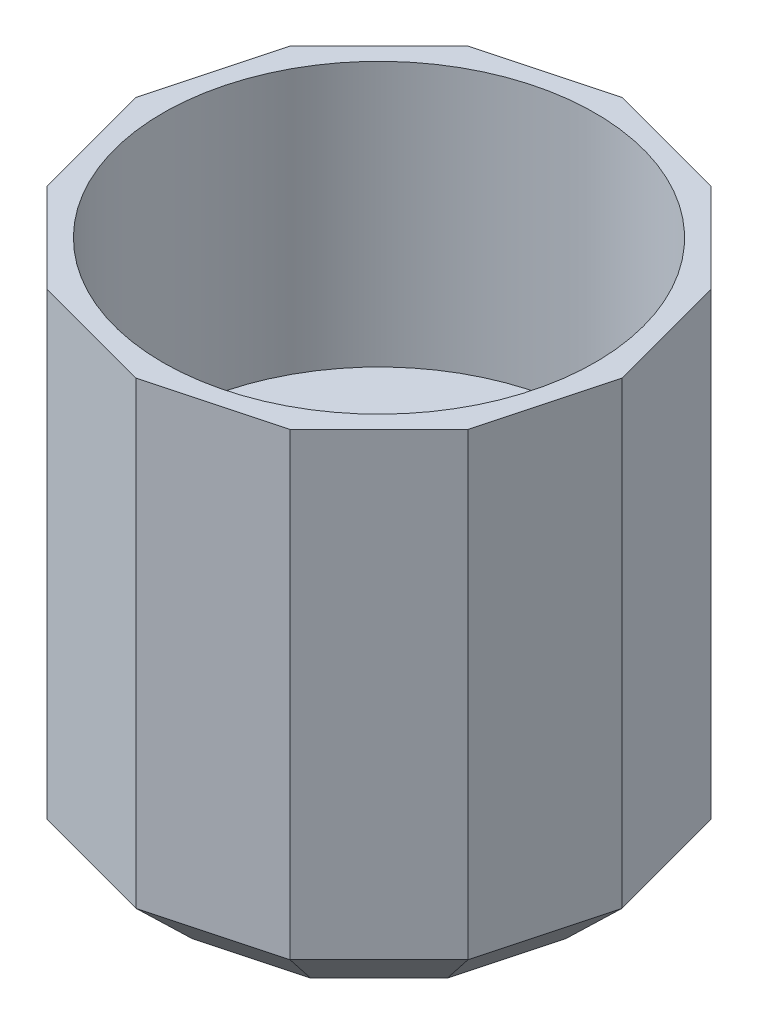
ISO-10303-21;
HEADER;
FILE_DESCRIPTION(('STEP AP214'),'2;1');
FILE_NAME('part.step','',(''),(''),'','','');
FILE_SCHEMA(('AUTOMOTIVE_DESIGN { 1 0 10303 214 1 1 1 1 }'));
ENDSEC;
DATA;
#1=APPLICATION_CONTEXT('core data for automotive mechanical design processes');
#2=APPLICATION_PROTOCOL_DEFINITION('international standard','automotive_design',2000,#1);
#3=PRODUCT_CONTEXT('',#1,'mechanical');
#4=PRODUCT('Part','Part','',(#3));
#5=PRODUCT_RELATED_PRODUCT_CATEGORY('part','',(#4));
#6=PRODUCT_DEFINITION_FORMATION('','',#4);
#7=PRODUCT_DEFINITION_CONTEXT('part definition',#1,'design');
#8=PRODUCT_DEFINITION('design','',#6,#7);
#9=PRODUCT_DEFINITION_SHAPE('','',#8);
#10=(LENGTH_UNIT() NAMED_UNIT(*) SI_UNIT(.MILLI.,.METRE.));
#11=(NAMED_UNIT(*) PLANE_ANGLE_UNIT() SI_UNIT($,.RADIAN.));
#12=(NAMED_UNIT(*) SI_UNIT($,.STERADIAN.) SOLID_ANGLE_UNIT());
#13=UNCERTAINTY_MEASURE_WITH_UNIT(LENGTH_MEASURE(1.E-05),#10,'distance_accuracy_value','');
#14=(GEOMETRIC_REPRESENTATION_CONTEXT(3) GLOBAL_UNCERTAINTY_ASSIGNED_CONTEXT((#13)) GLOBAL_UNIT_ASSIGNED_CONTEXT((#10,
#11,#12)) REPRESENTATION_CONTEXT('',''));
#15=CARTESIAN_POINT('',(0.,0.,0.));
#16=DIRECTION('',(0.,0.,1.));
#17=DIRECTION('',(1.,0.,0.));
#18=AXIS2_PLACEMENT_3D('',#15,#16,#17);
#19=CARTESIAN_POINT('',(0.,-4.8,0.));
#20=DIRECTION('',(0.,1.,0.));
#21=DIRECTION('',(0.,0.,1.));
#22=AXIS2_PLACEMENT_3D('',#19,#20,#21);
#23=CYLINDRICAL_SURFACE('',#22,3.05);
#24=CARTESIAN_POINT('',(0.,9.2,0.));
#25=DIRECTION('',(0.,1.,0.));
#26=DIRECTION('',(0.,0.,1.));
#27=AXIS2_PLACEMENT_3D('',#24,#25,#26);
#28=CIRCLE('',#27,3.05);
#29=CARTESIAN_POINT('',(0.,9.2,3.05));
#30=VERTEX_POINT('',#29);
#31=EDGE_CURVE('E216',#30,#30,#28,.T.);
#32=ORIENTED_EDGE('',*,*,#31,.T.);
#33=EDGE_LOOP('',(#32));
#34=FACE_BOUND('',#33,.T.);
#35=DIRECTION('',(0.,1.,0.));
#36=VECTOR('',#35,1.);
#37=CARTESIAN_POINT('',(-0.4,-4.8,3.02365672654817));
#38=LINE('',#37,#36);
#39=CARTESIAN_POINT('',(-0.4,6.2,3.02365672654817));
#40=VERTEX_POINT('',#39);
#41=CARTESIAN_POINT('',(-0.4,8.2,3.02365672654817));
#42=VERTEX_POINT('',#41);
#43=EDGE_CURVE('E206',#40,#42,#38,.T.);
#44=ORIENTED_EDGE('',*,*,#43,.F.);
#45=CARTESIAN_POINT('',(0.,6.2,0.));
#46=DIRECTION('',(0.,1.,0.));
#47=DIRECTION('',(0.,0.,1.));
#48=AXIS2_PLACEMENT_3D('',#45,#46,#47);
#49=CIRCLE('',#48,3.05);
#50=CARTESIAN_POINT('',(-0.4,6.2,-3.02365672654817));
#51=VERTEX_POINT('',#50);
#52=EDGE_CURVE('E58',#51,#40,#49,.T.);
#53=ORIENTED_EDGE('',*,*,#52,.F.);
#54=DIRECTION('',(0.,1.,0.));
#55=VECTOR('',#54,1.);
#56=CARTESIAN_POINT('',(-0.4,-4.8,-3.02365672654817));
#57=LINE('',#56,#55);
#58=CARTESIAN_POINT('',(-0.4,8.2,-3.02365672654817));
#59=VERTEX_POINT('',#58);
#60=EDGE_CURVE('E208',#59,#51,#57,.F.);
#61=ORIENTED_EDGE('',*,*,#60,.F.);
#62=CARTESIAN_POINT('',(0.,8.2,0.));
#63=DIRECTION('',(0.,-1.,0.));
#64=DIRECTION('',(0.,0.,-1.));
#65=AXIS2_PLACEMENT_3D('',#62,#63,#64);
#66=CIRCLE('',#65,3.05);
#67=CARTESIAN_POINT('',(0.4,8.2,-3.02365672654817));
#68=VERTEX_POINT('',#67);
#69=EDGE_CURVE('E337',#68,#59,#66,.F.);
#70=ORIENTED_EDGE('',*,*,#69,.F.);
#71=DIRECTION('',(0.,1.,0.));
#72=VECTOR('',#71,1.);
#73=CARTESIAN_POINT('',(0.4,-4.8,-3.02365672654817));
#74=LINE('',#73,#72);
#75=CARTESIAN_POINT('',(0.4,6.2,-3.02365672654817));
#76=VERTEX_POINT('',#75);
#77=EDGE_CURVE('E199',#76,#68,#74,.T.);
#78=ORIENTED_EDGE('',*,*,#77,.F.);
#79=CARTESIAN_POINT('',(0.4,6.2,3.02365672654817));
#80=VERTEX_POINT('',#79);
#81=EDGE_CURVE('E65',#80,#76,#49,.T.);
#82=ORIENTED_EDGE('',*,*,#81,.F.);
#83=DIRECTION('',(0.,1.,0.));
#84=VECTOR('',#83,1.);
#85=CARTESIAN_POINT('',(0.4,-4.8,3.02365672654817));
#86=LINE('',#85,#84);
#87=CARTESIAN_POINT('',(0.4,8.2,3.02365672654817));
#88=VERTEX_POINT('',#87);
#89=EDGE_CURVE('E197',#88,#80,#86,.F.);
#90=ORIENTED_EDGE('',*,*,#89,.F.);
#91=EDGE_CURVE('E52',#42,#88,#66,.F.);
#92=ORIENTED_EDGE('',*,*,#91,.F.);
#93=EDGE_LOOP('',(#44,#53,#61,#70,#78,#82,#90,#92));
#94=FACE_BOUND('',#93,.T.);
#95=ADVANCED_FACE('F43',(#34,#94),#23,.F.);
#96=CARTESIAN_POINT('',(4.49999999999993,19.,-7.79422863406));
#97=DIRECTION('',(-0.25881904510251,0.,0.965925826289071));
#98=DIRECTION('',(0.965925826289071,0.,0.25881904510251));
#99=AXIS2_PLACEMENT_3D('',#96,#97,#98);
#100=PLANE('',#99);
#101=DIRECTION('',(0.,-1.,0.));
#102=VECTOR('',#101,1.);
#103=CARTESIAN_POINT('',(4.49999999999993,19.,-7.79422863406));
#104=LINE('',#103,#102);
#105=CARTESIAN_POINT('',(4.49999999999993,19.,-7.79422863406));
#106=VERTEX_POINT('',#105);
#107=CARTESIAN_POINT('',(4.49999999999993,2.00000000000001,-7.79422863406));
#108=VERTEX_POINT('',#107);
#109=EDGE_CURVE('E251',#106,#108,#104,.T.);
#110=ORIENTED_EDGE('',*,*,#109,.T.);
#111=DIRECTION('',(-0.965925826289071,0.,-0.25881904510251));
#112=VECTOR('',#111,1.);
#113=CARTESIAN_POINT('',(4.49999999999993,2.00000000000001,-7.79422863406));
#114=LINE('',#113,#112);
#115=CARTESIAN_POINT('',(-1.01481323344643E-13,2.00000000000001,-9.));
#116=VERTEX_POINT('',#115);
#117=EDGE_CURVE('E327',#108,#116,#114,.T.);
#118=ORIENTED_EDGE('',*,*,#117,.T.);
#119=DIRECTION('',(0.,-1.,0.));
#120=VECTOR('',#119,1.);
#121=CARTESIAN_POINT('',(-1.01481323344643E-13,19.,-9.));
#122=LINE('',#121,#120);
#123=CARTESIAN_POINT('',(-1.01481323344643E-13,19.,-9.));
#124=VERTEX_POINT('',#123);
#125=EDGE_CURVE('E284',#124,#116,#122,.T.);
#126=ORIENTED_EDGE('',*,*,#125,.F.);
#127=DIRECTION('',(-0.965925826289071,0.,-0.25881904510251));
#128=VECTOR('',#127,1.);
#129=CARTESIAN_POINT('',(4.49999999999993,19.,-7.79422863406));
#130=LINE('',#129,#128);
#131=EDGE_CURVE('E224',#106,#124,#130,.T.);
#132=ORIENTED_EDGE('',*,*,#131,.F.);
#133=EDGE_LOOP('',(#110,#118,#126,#132));
#134=FACE_BOUND('',#133,.T.);
#135=ADVANCED_FACE('F387',(#134),#100,.F.);
#136=CARTESIAN_POINT('',(-1.01481323344643E-13,19.,-9.));
#137=DIRECTION('',(0.25881904510253,0.,0.965925826289066));
#138=DIRECTION('',(0.965925826289066,0.,-0.25881904510253));
#139=AXIS2_PLACEMENT_3D('',#136,#137,#138);
#140=PLANE('',#139);
#141=ORIENTED_EDGE('',*,*,#125,.T.);
#142=DIRECTION('',(-0.965925826289066,0.,0.25881904510253));
#143=VECTOR('',#142,1.);
#144=CARTESIAN_POINT('',(-1.01481323344643E-13,2.00000000000001,-9.));
#145=LINE('',#144,#143);
#146=CARTESIAN_POINT('',(-4.50000000000008,2.00000000000001,-7.79422863405991));
#147=VERTEX_POINT('',#146);
#148=EDGE_CURVE('E329',#116,#147,#145,.T.);
#149=ORIENTED_EDGE('',*,*,#148,.T.);
#150=DIRECTION('',(0.,-1.,0.));
#151=VECTOR('',#150,1.);
#152=CARTESIAN_POINT('',(-4.50000000000008,19.,-7.79422863405991));
#153=LINE('',#152,#151);
#154=CARTESIAN_POINT('',(-4.50000000000008,19.,-7.79422863405991));
#155=VERTEX_POINT('',#154);
#156=EDGE_CURVE('E281',#155,#147,#153,.T.);
#157=ORIENTED_EDGE('',*,*,#156,.F.);
#158=DIRECTION('',(-0.965925826289066,0.,0.25881904510253));
#159=VECTOR('',#158,1.);
#160=CARTESIAN_POINT('',(-1.01481323344643E-13,19.,-9.));
#161=LINE('',#160,#159);
#162=EDGE_CURVE('E229',#124,#155,#161,.T.);
#163=ORIENTED_EDGE('',*,*,#162,.F.);
#164=EDGE_LOOP('',(#141,#149,#157,#163));
#165=FACE_BOUND('',#164,.T.);
#166=ADVANCED_FACE('F395',(#165),#140,.F.);
#167=CARTESIAN_POINT('',(-4.50000000000008,19.,-7.79422863405991));
#168=DIRECTION('',(0.707106781186555,0.,0.70710678118654));
#169=DIRECTION('',(0.70710678118654,0.,-0.707106781186555));
#170=AXIS2_PLACEMENT_3D('',#167,#168,#169);
#171=PLANE('',#170);
#172=ORIENTED_EDGE('',*,*,#156,.T.);
#173=DIRECTION('',(-0.70710678118654,0.,0.707106781186555));
#174=VECTOR('',#173,1.);
#175=CARTESIAN_POINT('',(-4.50000000000008,2.00000000000001,-7.79422863405991));
#176=LINE('',#175,#174);
#177=CARTESIAN_POINT('',(-7.79422863406,2.00000000000001,-4.49999999999992));
#178=VERTEX_POINT('',#177);
#179=EDGE_CURVE('E331',#147,#178,#176,.T.);
#180=ORIENTED_EDGE('',*,*,#179,.T.);
#181=DIRECTION('',(0.,-1.,0.));
#182=VECTOR('',#181,1.);
#183=CARTESIAN_POINT('',(-7.79422863406,19.,-4.49999999999992));
#184=LINE('',#183,#182);
#185=CARTESIAN_POINT('',(-7.79422863406,19.,-4.49999999999992));
#186=VERTEX_POINT('',#185);
#187=EDGE_CURVE('E278',#186,#178,#184,.T.);
#188=ORIENTED_EDGE('',*,*,#187,.F.);
#189=DIRECTION('',(-0.70710678118654,0.,0.707106781186555));
#190=VECTOR('',#189,1.);
#191=CARTESIAN_POINT('',(-4.50000000000008,19.,-7.79422863405991));
#192=LINE('',#191,#190);
#193=EDGE_CURVE('E231',#155,#186,#192,.T.);
#194=ORIENTED_EDGE('',*,*,#193,.F.);
#195=EDGE_LOOP('',(#172,#180,#188,#194));
#196=FACE_BOUND('',#195,.T.);
#197=ADVANCED_FACE('F451',(#196),#171,.F.);
#198=CARTESIAN_POINT('',(-7.79422863406,19.,-4.49999999999992));
#199=DIRECTION('',(0.965925826289071,0.,0.258819045102509));
#200=DIRECTION('',(0.258819045102509,0.,-0.965925826289071));
#201=AXIS2_PLACEMENT_3D('',#198,#199,#200);
#202=PLANE('',#201);
#203=ORIENTED_EDGE('',*,*,#187,.T.);
#204=DIRECTION('',(-0.258819045102509,0.,0.965925826289071));
#205=VECTOR('',#204,1.);
#206=CARTESIAN_POINT('',(-7.79422863406,2.00000000000001,-4.49999999999992));
#207=LINE('',#206,#205);
#208=CARTESIAN_POINT('',(-9.,2.00000000000001,1.0321604682062E-13));
#209=VERTEX_POINT('',#208);
#210=EDGE_CURVE('E333',#178,#209,#207,.T.);
#211=ORIENTED_EDGE('',*,*,#210,.T.);
#212=DIRECTION('',(0.,-1.,0.));
#213=VECTOR('',#212,1.);
#214=CARTESIAN_POINT('',(-9.,19.,1.0321604682062E-13));
#215=LINE('',#214,#213);
#216=CARTESIAN_POINT('',(-9.,19.,1.0321604682062E-13));
#217=VERTEX_POINT('',#216);
#218=EDGE_CURVE('E275',#217,#209,#215,.T.);
#219=ORIENTED_EDGE('',*,*,#218,.F.);
#220=DIRECTION('',(-0.258819045102509,0.,0.965925826289071));
#221=VECTOR('',#220,1.);
#222=CARTESIAN_POINT('',(-7.79422863406,19.,-4.49999999999992));
#223=LINE('',#222,#221);
#224=EDGE_CURVE('E233',#186,#217,#223,.T.);
#225=ORIENTED_EDGE('',*,*,#224,.F.);
#226=EDGE_LOOP('',(#203,#211,#219,#225));
#227=FACE_BOUND('',#226,.T.);
#228=ADVANCED_FACE('F447',(#227),#202,.F.);
#229=CARTESIAN_POINT('',(-9.,19.,1.0321604682062E-13));
#230=DIRECTION('',(0.965925826289066,0.,-0.25881904510253));
#231=DIRECTION('',(-0.25881904510253,0.,-0.965925826289066));
#232=AXIS2_PLACEMENT_3D('',#229,#230,#231);
#233=PLANE('',#232);
#234=ORIENTED_EDGE('',*,*,#218,.T.);
#235=DIRECTION('',(0.25881904510253,0.,0.965925826289066));
#236=VECTOR('',#235,1.);
#237=CARTESIAN_POINT('',(-9.,2.00000000000001,1.0321604682062E-13));
#238=LINE('',#237,#236);
#239=CARTESIAN_POINT('',(-7.7942286340599,2.00000000000001,4.50000000000008));
#240=VERTEX_POINT('',#239);
#241=EDGE_CURVE('E335',#209,#240,#238,.T.);
#242=ORIENTED_EDGE('',*,*,#241,.T.);
#243=DIRECTION('',(0.,-1.,0.));
#244=VECTOR('',#243,1.);
#245=CARTESIAN_POINT('',(-7.7942286340599,19.,4.50000000000008));
#246=LINE('',#245,#244);
#247=CARTESIAN_POINT('',(-7.7942286340599,19.,4.50000000000008));
#248=VERTEX_POINT('',#247);
#249=EDGE_CURVE('E272',#248,#240,#246,.T.);
#250=ORIENTED_EDGE('',*,*,#249,.F.);
#251=DIRECTION('',(0.25881904510253,0.,0.965925826289066));
#252=VECTOR('',#251,1.);
#253=CARTESIAN_POINT('',(-9.,19.,1.0321604682062E-13));
#254=LINE('',#253,#252);
#255=EDGE_CURVE('E235',#217,#248,#254,.T.);
#256=ORIENTED_EDGE('',*,*,#255,.F.);
#257=EDGE_LOOP('',(#234,#242,#250,#256));
#258=FACE_BOUND('',#257,.T.);
#259=ADVANCED_FACE('F443',(#258),#233,.F.);
#260=CARTESIAN_POINT('',(-7.7942286340599,19.,4.50000000000008));
#261=DIRECTION('',(0.70710678118654,0.,-0.707106781186555));
#262=DIRECTION('',(-0.707106781186555,0.,-0.70710678118654));
#263=AXIS2_PLACEMENT_3D('',#260,#261,#262);
#264=PLANE('',#263);
#265=ORIENTED_EDGE('',*,*,#249,.T.);
#266=DIRECTION('',(0.707106781186555,0.,0.70710678118654));
#267=VECTOR('',#266,1.);
#268=CARTESIAN_POINT('',(-7.7942286340599,2.00000000000001,4.50000000000008));
#269=LINE('',#268,#267);
#270=CARTESIAN_POINT('',(-4.49999999999992,2.00000000000001,7.79422863406));
#271=VERTEX_POINT('',#270);
#272=EDGE_CURVE('E287',#240,#271,#269,.T.);
#273=ORIENTED_EDGE('',*,*,#272,.T.);
#274=DIRECTION('',(0.,-1.,0.));
#275=VECTOR('',#274,1.);
#276=CARTESIAN_POINT('',(-4.49999999999992,19.,7.79422863406));
#277=LINE('',#276,#275);
#278=CARTESIAN_POINT('',(-4.49999999999992,19.,7.79422863406));
#279=VERTEX_POINT('',#278);
#280=EDGE_CURVE('E269',#279,#271,#277,.T.);
#281=ORIENTED_EDGE('',*,*,#280,.F.);
#282=DIRECTION('',(0.707106781186555,0.,0.70710678118654));
#283=VECTOR('',#282,1.);
#284=CARTESIAN_POINT('',(-7.7942286340599,19.,4.50000000000008));
#285=LINE('',#284,#283);
#286=EDGE_CURVE('E237',#248,#279,#285,.T.);
#287=ORIENTED_EDGE('',*,*,#286,.F.);
#288=EDGE_LOOP('',(#265,#273,#281,#287));
#289=FACE_BOUND('',#288,.T.);
#290=ADVANCED_FACE('F439',(#289),#264,.F.);
#291=CARTESIAN_POINT('',(-4.49999999999992,19.,7.79422863406));
#292=DIRECTION('',(0.25881904510251,0.,-0.965925826289071));
#293=DIRECTION('',(-0.965925826289071,0.,-0.25881904510251));
#294=AXIS2_PLACEMENT_3D('',#291,#292,#293);
#295=PLANE('',#294);
#296=ORIENTED_EDGE('',*,*,#280,.T.);
#297=DIRECTION('',(0.965925826289071,0.,0.25881904510251));
#298=VECTOR('',#297,1.);
#299=CARTESIAN_POINT('',(-4.49999999999992,2.00000000000001,7.79422863406));
#300=LINE('',#299,#298);
#301=CARTESIAN_POINT('',(0.,2.00000000000001,9.));
#302=VERTEX_POINT('',#301);
#303=EDGE_CURVE('E315',#271,#302,#300,.T.);
#304=ORIENTED_EDGE('',*,*,#303,.T.);
#305=DIRECTION('',(0.,-1.,0.));
#306=VECTOR('',#305,1.);
#307=CARTESIAN_POINT('',(0.,19.,9.));
#308=LINE('',#307,#306);
#309=CARTESIAN_POINT('',(0.,19.,9.));
#310=VERTEX_POINT('',#309);
#311=EDGE_CURVE('E266',#310,#302,#308,.T.);
#312=ORIENTED_EDGE('',*,*,#311,.F.);
#313=DIRECTION('',(0.965925826289071,0.,0.25881904510251));
#314=VECTOR('',#313,1.);
#315=CARTESIAN_POINT('',(-4.49999999999992,19.,7.79422863406));
#316=LINE('',#315,#314);
#317=EDGE_CURVE('E239',#279,#310,#316,.T.);
#318=ORIENTED_EDGE('',*,*,#317,.F.);
#319=EDGE_LOOP('',(#296,#304,#312,#318));
#320=FACE_BOUND('',#319,.T.);
#321=ADVANCED_FACE('F435',(#320),#295,.F.);
#322=CARTESIAN_POINT('',(0.,19.,9.));
#323=DIRECTION('',(-0.25881904510253,0.,-0.965925826289066));
#324=DIRECTION('',(-0.965925826289066,0.,0.25881904510253));
#325=AXIS2_PLACEMENT_3D('',#322,#323,#324);
#326=PLANE('',#325);
#327=ORIENTED_EDGE('',*,*,#311,.T.);
#328=DIRECTION('',(0.965925826289066,0.,-0.25881904510253));
#329=VECTOR('',#328,1.);
#330=CARTESIAN_POINT('',(0.,2.00000000000001,9.));
#331=LINE('',#330,#329);
#332=CARTESIAN_POINT('',(4.50000000000008,2.00000000000001,7.7942286340599));
#333=VERTEX_POINT('',#332);
#334=EDGE_CURVE('E317',#302,#333,#331,.T.);
#335=ORIENTED_EDGE('',*,*,#334,.T.);
#336=DIRECTION('',(0.,-1.,0.));
#337=VECTOR('',#336,1.);
#338=CARTESIAN_POINT('',(4.50000000000008,19.,7.7942286340599));
#339=LINE('',#338,#337);
#340=CARTESIAN_POINT('',(4.50000000000008,19.,7.7942286340599));
#341=VERTEX_POINT('',#340);
#342=EDGE_CURVE('E263',#341,#333,#339,.T.);
#343=ORIENTED_EDGE('',*,*,#342,.F.);
#344=DIRECTION('',(0.965925826289066,0.,-0.25881904510253));
#345=VECTOR('',#344,1.);
#346=CARTESIAN_POINT('',(0.,19.,9.));
#347=LINE('',#346,#345);
#348=EDGE_CURVE('E241',#310,#341,#347,.T.);
#349=ORIENTED_EDGE('',*,*,#348,.F.);
#350=EDGE_LOOP('',(#327,#335,#343,#349));
#351=FACE_BOUND('',#350,.T.);
#352=ADVANCED_FACE('F431',(#351),#326,.F.);
#353=CARTESIAN_POINT('',(4.50000000000008,19.,7.7942286340599));
#354=DIRECTION('',(-0.707106781186555,0.,-0.70710678118654));
#355=DIRECTION('',(-0.70710678118654,0.,0.707106781186555));
#356=AXIS2_PLACEMENT_3D('',#353,#354,#355);
#357=PLANE('',#356);
#358=ORIENTED_EDGE('',*,*,#342,.T.);
#359=DIRECTION('',(0.70710678118654,0.,-0.707106781186555));
#360=VECTOR('',#359,1.);
#361=CARTESIAN_POINT('',(4.50000000000008,2.00000000000001,7.7942286340599));
#362=LINE('',#361,#360);
#363=CARTESIAN_POINT('',(7.79422863406,2.00000000000001,4.49999999999992));
#364=VERTEX_POINT('',#363);
#365=EDGE_CURVE('E319',#333,#364,#362,.T.);
#366=ORIENTED_EDGE('',*,*,#365,.T.);
#367=DIRECTION('',(0.,-1.,0.));
#368=VECTOR('',#367,1.);
#369=CARTESIAN_POINT('',(7.79422863406,19.,4.49999999999992));
#370=LINE('',#369,#368);
#371=CARTESIAN_POINT('',(7.79422863406,19.,4.49999999999992));
#372=VERTEX_POINT('',#371);
#373=EDGE_CURVE('E260',#372,#364,#370,.T.);
#374=ORIENTED_EDGE('',*,*,#373,.F.);
#375=DIRECTION('',(0.70710678118654,0.,-0.707106781186555));
#376=VECTOR('',#375,1.);
#377=CARTESIAN_POINT('',(4.50000000000008,19.,7.7942286340599));
#378=LINE('',#377,#376);
#379=EDGE_CURVE('E243',#341,#372,#378,.T.);
#380=ORIENTED_EDGE('',*,*,#379,.F.);
#381=EDGE_LOOP('',(#358,#366,#374,#380));
#382=FACE_BOUND('',#381,.T.);
#383=ADVANCED_FACE('F427',(#382),#357,.F.);
#384=CARTESIAN_POINT('',(7.79422863406,19.,4.49999999999992));
#385=DIRECTION('',(-0.965925826289071,0.,-0.25881904510251));
#386=DIRECTION('',(-0.25881904510251,0.,0.965925826289071));
#387=AXIS2_PLACEMENT_3D('',#384,#385,#386);
#388=PLANE('',#387);
#389=ORIENTED_EDGE('',*,*,#373,.T.);
#390=DIRECTION('',(0.25881904510251,0.,-0.965925826289071));
#391=VECTOR('',#390,1.);
#392=CARTESIAN_POINT('',(7.79422863406,2.00000000000001,4.49999999999992));
#393=LINE('',#392,#391);
#394=CARTESIAN_POINT('',(9.,2.00000000000001,0.));
#395=VERTEX_POINT('',#394);
#396=EDGE_CURVE('E321',#364,#395,#393,.T.);
#397=ORIENTED_EDGE('',*,*,#396,.T.);
#398=DIRECTION('',(0.,-1.,0.));
#399=VECTOR('',#398,1.);
#400=CARTESIAN_POINT('',(9.,19.,0.));
#401=LINE('',#400,#399);
#402=CARTESIAN_POINT('',(9.,19.,0.));
#403=VERTEX_POINT('',#402);
#404=EDGE_CURVE('E257',#403,#395,#401,.T.);
#405=ORIENTED_EDGE('',*,*,#404,.F.);
#406=DIRECTION('',(0.25881904510251,0.,-0.965925826289071));
#407=VECTOR('',#406,1.);
#408=CARTESIAN_POINT('',(7.79422863406,19.,4.49999999999992));
#409=LINE('',#408,#407);
#410=EDGE_CURVE('E245',#372,#403,#409,.T.);
#411=ORIENTED_EDGE('',*,*,#410,.F.);
#412=EDGE_LOOP('',(#389,#397,#405,#411));
#413=FACE_BOUND('',#412,.T.);
#414=ADVANCED_FACE('F423',(#413),#388,.F.);
#415=CARTESIAN_POINT('',(9.,19.,0.));
#416=DIRECTION('',(-0.965925826289066,0.,0.258819045102529));
#417=DIRECTION('',(0.258819045102529,0.,0.965925826289066));
#418=AXIS2_PLACEMENT_3D('',#415,#416,#417);
#419=PLANE('',#418);
#420=ORIENTED_EDGE('',*,*,#404,.T.);
#421=DIRECTION('',(-0.258819045102529,0.,-0.965925826289066));
#422=VECTOR('',#421,1.);
#423=CARTESIAN_POINT('',(9.,2.00000000000001,0.));
#424=LINE('',#423,#422);
#425=CARTESIAN_POINT('',(7.79422863405991,2.00000000000001,-4.50000000000008));
#426=VERTEX_POINT('',#425);
#427=EDGE_CURVE('E323',#395,#426,#424,.T.);
#428=ORIENTED_EDGE('',*,*,#427,.T.);
#429=DIRECTION('',(0.,-1.,0.));
#430=VECTOR('',#429,1.);
#431=CARTESIAN_POINT('',(7.79422863405991,19.,-4.50000000000008));
#432=LINE('',#431,#430);
#433=CARTESIAN_POINT('',(7.79422863405991,19.,-4.50000000000008));
#434=VERTEX_POINT('',#433);
#435=EDGE_CURVE('E254',#434,#426,#432,.T.);
#436=ORIENTED_EDGE('',*,*,#435,.F.);
#437=DIRECTION('',(-0.258819045102529,0.,-0.965925826289066));
#438=VECTOR('',#437,1.);
#439=CARTESIAN_POINT('',(9.,19.,0.));
#440=LINE('',#439,#438);
#441=EDGE_CURVE('E247',#403,#434,#440,.T.);
#442=ORIENTED_EDGE('',*,*,#441,.F.);
#443=EDGE_LOOP('',(#420,#428,#436,#442));
#444=FACE_BOUND('',#443,.T.);
#445=ADVANCED_FACE('F419',(#444),#419,.F.);
#446=CARTESIAN_POINT('',(7.79422863405991,19.,-4.50000000000008));
#447=DIRECTION('',(-0.707106781186541,0.,0.707106781186555));
#448=DIRECTION('',(0.707106781186555,0.,0.707106781186541));
#449=AXIS2_PLACEMENT_3D('',#446,#447,#448);
#450=PLANE('',#449);
#451=ORIENTED_EDGE('',*,*,#435,.T.);
#452=DIRECTION('',(-0.707106781186555,0.,-0.707106781186541));
#453=VECTOR('',#452,1.);
#454=CARTESIAN_POINT('',(7.79422863405991,2.00000000000001,-4.50000000000008));
#455=LINE('',#454,#453);
#456=EDGE_CURVE('E325',#426,#108,#455,.T.);
#457=ORIENTED_EDGE('',*,*,#456,.T.);
#458=ORIENTED_EDGE('',*,*,#109,.F.);
#459=DIRECTION('',(-0.707106781186554,0.,-0.70710678118654));
#460=VECTOR('',#459,1.);
#461=CARTESIAN_POINT('',(7.79422863405991,19.,-4.50000000000008));
#462=LINE('',#461,#460);
#463=EDGE_CURVE('E249',#434,#106,#462,.T.);
#464=ORIENTED_EDGE('',*,*,#463,.F.);
#465=EDGE_LOOP('',(#451,#457,#458,#464));
#466=FACE_BOUND('',#465,.T.);
#467=ADVANCED_FACE('F413',(#466),#450,.F.);
#468=CARTESIAN_POINT('',(0.,19.,0.));
#469=DIRECTION('',(0.,1.,0.));
#470=DIRECTION('',(0.,0.,1.));
#471=AXIS2_PLACEMENT_3D('',#468,#469,#470);
#472=PLANE('',#471);
#473=CARTESIAN_POINT('',(0.,19.,0.));
#474=DIRECTION('',(0.,1.,0.));
#475=DIRECTION('',(0.,0.,1.));
#476=AXIS2_PLACEMENT_3D('',#473,#474,#475);
#477=CIRCLE('',#476,8.);
#478=CARTESIAN_POINT('',(0.,19.,8.));
#479=VERTEX_POINT('',#478);
#480=EDGE_CURVE('E219',#479,#479,#477,.T.);
#481=ORIENTED_EDGE('',*,*,#480,.F.);
#482=EDGE_LOOP('',(#481));
#483=FACE_BOUND('',#482,.T.);
#484=ORIENTED_EDGE('',*,*,#131,.T.);
#485=ORIENTED_EDGE('',*,*,#162,.T.);
#486=ORIENTED_EDGE('',*,*,#193,.T.);
#487=ORIENTED_EDGE('',*,*,#224,.T.);
#488=ORIENTED_EDGE('',*,*,#255,.T.);
#489=ORIENTED_EDGE('',*,*,#286,.T.);
#490=ORIENTED_EDGE('',*,*,#317,.T.);
#491=ORIENTED_EDGE('',*,*,#348,.T.);
#492=ORIENTED_EDGE('',*,*,#379,.T.);
#493=ORIENTED_EDGE('',*,*,#410,.T.);
#494=ORIENTED_EDGE('',*,*,#441,.T.);
#495=ORIENTED_EDGE('',*,*,#463,.T.);
#496=EDGE_LOOP('',(#484,#485,#486,#487,#488,#489,#490,#491,#492,#493,#494,#495));
#497=FACE_BOUND('',#496,.T.);
#498=ADVANCED_FACE('F410',(#483,#497),#472,.T.);
#499=CARTESIAN_POINT('',(0.,0.,0.));
#500=DIRECTION('',(0.,1.,0.));
#501=DIRECTION('',(0.,0.,1.));
#502=AXIS2_PLACEMENT_3D('',#499,#500,#501);
#503=PLANE('',#502);
#504=DIRECTION('',(-0.965925826289071,0.,-0.25881904510251));
#505=VECTOR('',#504,1.);
#506=CARTESIAN_POINT('',(-1.73236190979488,0.,6.46526266445185));
#507=LINE('',#506,#505);
#508=CARTESIAN_POINT('',(0.,0.,6.92944763917982));
#509=VERTEX_POINT('',#508);
#510=CARTESIAN_POINT('',(-3.46472381958985,0.,6.00107768972387));
#511=VERTEX_POINT('',#510);
#512=EDGE_CURVE('E310',#509,#511,#507,.T.);
#513=ORIENTED_EDGE('',*,*,#512,.T.);
#514=DIRECTION('',(-0.707106781186555,0.,-0.70710678118654));
#515=VECTOR('',#514,1.);
#516=CARTESIAN_POINT('',(-4.73290075465682,0.,4.73290075465692));
#517=LINE('',#516,#515);
#518=CARTESIAN_POINT('',(-6.0010776897238,0.,3.46472381958997));
#519=VERTEX_POINT('',#518);
#520=EDGE_CURVE('E312',#511,#519,#517,.T.);
#521=ORIENTED_EDGE('',*,*,#520,.T.);
#522=DIRECTION('',(-0.25881904510253,0.,-0.965925826289066));
#523=VECTOR('',#522,1.);
#524=CARTESIAN_POINT('',(-6.46526266445181,0.,1.73236190979502));
#525=LINE('',#524,#523);
#526=CARTESIAN_POINT('',(-6.92944763917982,0.,0.));
#527=VERTEX_POINT('',#526);
#528=EDGE_CURVE('E290',#519,#527,#525,.T.);
#529=ORIENTED_EDGE('',*,*,#528,.T.);
#530=DIRECTION('',(0.258819045102509,0.,-0.965925826289071));
#531=VECTOR('',#530,1.);
#532=CARTESIAN_POINT('',(-6.46526266445184,0.,-1.73236190979488));
#533=LINE('',#532,#531);
#534=CARTESIAN_POINT('',(-6.00107768972386,0.,-3.46472381958985));
#535=VERTEX_POINT('',#534);
#536=EDGE_CURVE('E292',#527,#535,#533,.T.);
#537=ORIENTED_EDGE('',*,*,#536,.T.);
#538=DIRECTION('',(0.70710678118654,0.,-0.707106781186555));
#539=VECTOR('',#538,1.);
#540=CARTESIAN_POINT('',(-4.73290075465692,0.,-4.73290075465682));
#541=LINE('',#540,#539);
#542=CARTESIAN_POINT('',(-3.46472381958997,0.,-6.0010776897238));
#543=VERTEX_POINT('',#542);
#544=EDGE_CURVE('E294',#535,#543,#541,.T.);
#545=ORIENTED_EDGE('',*,*,#544,.T.);
#546=DIRECTION('',(0.965925826289066,0.,-0.25881904510253));
#547=VECTOR('',#546,1.);
#548=CARTESIAN_POINT('',(-1.73236190979502,0.,-6.46526266445181));
#549=LINE('',#548,#547);
#550=CARTESIAN_POINT('',(0.,0.,-6.92944763917982));
#551=VERTEX_POINT('',#550);
#552=EDGE_CURVE('E296',#543,#551,#549,.T.);
#553=ORIENTED_EDGE('',*,*,#552,.T.);
#554=DIRECTION('',(0.965925826289071,0.,0.25881904510251));
#555=VECTOR('',#554,1.);
#556=CARTESIAN_POINT('',(1.73236190979488,0.,-6.46526266445184));
#557=LINE('',#556,#555);
#558=CARTESIAN_POINT('',(3.46472381958985,0.,-6.00107768972387));
#559=VERTEX_POINT('',#558);
#560=EDGE_CURVE('E298',#551,#559,#557,.T.);
#561=ORIENTED_EDGE('',*,*,#560,.T.);
#562=DIRECTION('',(0.707106781186555,0.,0.707106781186541));
#563=VECTOR('',#562,1.);
#564=CARTESIAN_POINT('',(4.73290075465683,0.,-4.73290075465692));
#565=LINE('',#564,#563);
#566=CARTESIAN_POINT('',(6.0010776897238,0.,-3.46472381958997));
#567=VERTEX_POINT('',#566);
#568=EDGE_CURVE('E300',#559,#567,#565,.T.);
#569=ORIENTED_EDGE('',*,*,#568,.T.);
#570=DIRECTION('',(0.258819045102529,0.,0.965925826289066));
#571=VECTOR('',#570,1.);
#572=CARTESIAN_POINT('',(6.46526266445181,0.,-1.73236190979501));
#573=LINE('',#572,#571);
#574=CARTESIAN_POINT('',(6.92944763917982,0.,0.));
#575=VERTEX_POINT('',#574);
#576=EDGE_CURVE('E302',#567,#575,#573,.T.);
#577=ORIENTED_EDGE('',*,*,#576,.T.);
#578=DIRECTION('',(-0.25881904510251,0.,0.965925826289071));
#579=VECTOR('',#578,1.);
#580=CARTESIAN_POINT('',(6.46526266445184,0.,1.73236190979488));
#581=LINE('',#580,#579);
#582=CARTESIAN_POINT('',(6.00107768972387,0.,3.46472381958985));
#583=VERTEX_POINT('',#582);
#584=EDGE_CURVE('E304',#575,#583,#581,.T.);
#585=ORIENTED_EDGE('',*,*,#584,.T.);
#586=DIRECTION('',(-0.70710678118654,0.,0.707106781186555));
#587=VECTOR('',#586,1.);
#588=CARTESIAN_POINT('',(4.73290075465692,0.,4.73290075465682));
#589=LINE('',#588,#587);
#590=CARTESIAN_POINT('',(3.46472381958997,0.,6.0010776897238));
#591=VERTEX_POINT('',#590);
#592=EDGE_CURVE('E306',#583,#591,#589,.T.);
#593=ORIENTED_EDGE('',*,*,#592,.T.);
#594=DIRECTION('',(-0.965925826289066,0.,0.25881904510253));
#595=VECTOR('',#594,1.);
#596=CARTESIAN_POINT('',(1.73236190979502,0.,6.46526266445181));
#597=LINE('',#596,#595);
#598=EDGE_CURVE('E308',#591,#509,#597,.T.);
#599=ORIENTED_EDGE('',*,*,#598,.T.);
#600=EDGE_LOOP('',(#513,#521,#529,#537,#545,#553,#561,#569,#577,#585,#593,#599));
#601=FACE_BOUND('',#600,.T.);
#602=ADVANCED_FACE('F408',(#601),#503,.F.);
#603=CARTESIAN_POINT('',(0.,9.2,0.));
#604=DIRECTION('',(0.,1.,0.));
#605=DIRECTION('',(0.,0.,1.));
#606=AXIS2_PLACEMENT_3D('',#603,#604,#605);
#607=CYLINDRICAL_SURFACE('',#606,8.);
#608=CARTESIAN_POINT('',(0.,9.2,0.));
#609=DIRECTION('',(0.,1.,0.));
#610=DIRECTION('',(0.,0.,1.));
#611=AXIS2_PLACEMENT_3D('',#608,#609,#610);
#612=CIRCLE('',#611,8.);
#613=CARTESIAN_POINT('',(0.,9.2,8.));
#614=VERTEX_POINT('',#613);
#615=EDGE_CURVE('E221',#614,#614,#612,.T.);
#616=ORIENTED_EDGE('',*,*,#615,.F.);
#617=EDGE_LOOP('',(#616));
#618=FACE_BOUND('',#617,.T.);
#619=ORIENTED_EDGE('',*,*,#480,.T.);
#620=EDGE_LOOP('',(#619));
#621=FACE_BOUND('',#620,.T.);
#622=ADVANCED_FACE('F404',(#618,#621),#607,.F.);
#623=CARTESIAN_POINT('',(0.,9.2,0.));
#624=DIRECTION('',(0.,1.,0.));
#625=DIRECTION('',(0.,0.,1.));
#626=AXIS2_PLACEMENT_3D('',#623,#624,#625);
#627=PLANE('',#626);
#628=ORIENTED_EDGE('',*,*,#31,.F.);
#629=EDGE_LOOP('',(#628));
#630=FACE_BOUND('',#629,.T.);
#631=ORIENTED_EDGE('',*,*,#615,.T.);
#632=EDGE_LOOP('',(#631));
#633=FACE_BOUND('',#632,.T.);
#634=ADVANCED_FACE('F401',(#630,#633),#627,.T.);
#635=CARTESIAN_POINT('',(7.79422863405991,2.00000000000001,-4.50000000000008));
#636=DIRECTION('',(-0.499999999999994,0.707106781186549,0.500000000000004));
#637=DIRECTION('',(-0.707106781186555,0.,-0.707106781186541));
#638=AXIS2_PLACEMENT_3D('',#635,#636,#637);
#639=PLANE('',#638);
#640=DIRECTION('',(-0.622892752510493,-0.694746590606864,0.359627298338209));
#641=VECTOR('',#640,1.);
#642=CARTESIAN_POINT('',(7.79422863405991,2.00000000000001,-4.50000000000008));
#643=LINE('',#642,#641);
#644=EDGE_CURVE('E365',#567,#426,#643,.F.);
#645=ORIENTED_EDGE('',*,*,#644,.F.);
#646=ORIENTED_EDGE('',*,*,#568,.F.);
#647=DIRECTION('',(-0.359627298338196,-0.694746590606864,0.622892752510501));
#648=VECTOR('',#647,1.);
#649=CARTESIAN_POINT('',(4.49999999999993,2.00000000000001,-7.79422863406));
#650=LINE('',#649,#648);
#651=EDGE_CURVE('E220',#108,#559,#650,.T.);
#652=ORIENTED_EDGE('',*,*,#651,.F.);
#653=ORIENTED_EDGE('',*,*,#456,.F.);
#654=EDGE_LOOP('',(#645,#646,#652,#653));
#655=FACE_BOUND('',#654,.T.);
#656=ADVANCED_FACE('F46',(#655),#639,.F.);
#657=CARTESIAN_POINT('',(4.49999999999993,2.00000000000001,-7.79422863406));
#658=DIRECTION('',(-0.183012701892211,0.707106781186549,0.68301270189222));
#659=DIRECTION('',(-0.965925826289071,0.,-0.25881904510251));
#660=AXIS2_PLACEMENT_3D('',#657,#658,#659);
#661=PLANE('',#660);
#662=ORIENTED_EDGE('',*,*,#651,.T.);
#663=ORIENTED_EDGE('',*,*,#560,.F.);
#664=DIRECTION('',(0.,-0.694746590606865,0.719254596676405));
#665=VECTOR('',#664,1.);
#666=CARTESIAN_POINT('',(-1.01777532886734E-13,2.00000000000001,-9.));
#667=LINE('',#666,#665);
#668=EDGE_CURVE('E362',#116,#551,#667,.T.);
#669=ORIENTED_EDGE('',*,*,#668,.F.);
#670=ORIENTED_EDGE('',*,*,#117,.F.);
#671=EDGE_LOOP('',(#662,#663,#669,#670));
#672=FACE_BOUND('',#671,.T.);
#673=ADVANCED_FACE('F528',(#672),#661,.F.);
#674=CARTESIAN_POINT('',(9.,2.00000000000001,0.));
#675=DIRECTION('',(-0.683012701892217,0.707106781186549,0.183012701892225));
#676=DIRECTION('',(-0.258819045102529,0.,-0.965925826289066));
#677=AXIS2_PLACEMENT_3D('',#674,#675,#676);
#678=PLANE('',#677);
#679=ORIENTED_EDGE('',*,*,#644,.T.);
#680=ORIENTED_EDGE('',*,*,#427,.F.);
#681=DIRECTION('',(-0.719254596676405,-0.694746590606865,0.));
#682=VECTOR('',#681,1.);
#683=CARTESIAN_POINT('',(9.,2.00000000000001,0.));
#684=LINE('',#683,#682);
#685=EDGE_CURVE('E359',#575,#395,#684,.F.);
#686=ORIENTED_EDGE('',*,*,#685,.F.);
#687=ORIENTED_EDGE('',*,*,#576,.F.);
#688=EDGE_LOOP('',(#679,#680,#686,#687));
#689=FACE_BOUND('',#688,.T.);
#690=ADVANCED_FACE('F522',(#689),#678,.F.);
#691=CARTESIAN_POINT('',(-1.01481323344643E-13,2.00000000000001,-9.));
#692=DIRECTION('',(0.183012701892226,0.707106781186549,0.683012701892216));
#693=DIRECTION('',(-0.965925826289066,0.,0.25881904510253));
#694=AXIS2_PLACEMENT_3D('',#691,#692,#693);
#695=PLANE('',#694);
#696=ORIENTED_EDGE('',*,*,#668,.T.);
#697=ORIENTED_EDGE('',*,*,#552,.F.);
#698=DIRECTION('',(0.35962729833821,-0.694746590606865,0.622892752510493));
#699=VECTOR('',#698,1.);
#700=CARTESIAN_POINT('',(-4.50000000000008,2.00000000000001,-7.79422863405991));
#701=LINE('',#700,#699);
#702=EDGE_CURVE('E356',#147,#543,#701,.T.);
#703=ORIENTED_EDGE('',*,*,#702,.F.);
#704=ORIENTED_EDGE('',*,*,#148,.F.);
#705=EDGE_LOOP('',(#696,#697,#703,#704));
#706=FACE_BOUND('',#705,.T.);
#707=ADVANCED_FACE('F515',(#706),#695,.F.);
#708=CARTESIAN_POINT('',(7.79422863406,2.00000000000001,4.49999999999992));
#709=DIRECTION('',(-0.68301270189222,0.707106781186549,-0.183012701892211));
#710=DIRECTION('',(0.25881904510251,0.,-0.965925826289071));
#711=AXIS2_PLACEMENT_3D('',#708,#709,#710);
#712=PLANE('',#711);
#713=ORIENTED_EDGE('',*,*,#685,.T.);
#714=ORIENTED_EDGE('',*,*,#396,.F.);
#715=DIRECTION('',(-0.622892752510501,-0.694746590606865,-0.359627298338196));
#716=VECTOR('',#715,1.);
#717=CARTESIAN_POINT('',(7.79422863406,2.00000000000001,4.49999999999992));
#718=LINE('',#717,#716);
#719=EDGE_CURVE('E353',#583,#364,#718,.F.);
#720=ORIENTED_EDGE('',*,*,#719,.F.);
#721=ORIENTED_EDGE('',*,*,#584,.F.);
#722=EDGE_LOOP('',(#713,#714,#720,#721));
#723=FACE_BOUND('',#722,.T.);
#724=ADVANCED_FACE('F508',(#723),#712,.F.);
#725=CARTESIAN_POINT('',(-4.50000000000008,2.00000000000001,-7.79422863405991));
#726=DIRECTION('',(0.500000000000004,0.707106781186549,0.499999999999994));
#727=DIRECTION('',(-0.70710678118654,0.,0.707106781186555));
#728=AXIS2_PLACEMENT_3D('',#725,#726,#727);
#729=PLANE('',#728);
#730=ORIENTED_EDGE('',*,*,#702,.T.);
#731=ORIENTED_EDGE('',*,*,#544,.F.);
#732=DIRECTION('',(0.622892752510501,-0.694746590606864,0.359627298338196));
#733=VECTOR('',#732,1.);
#734=CARTESIAN_POINT('',(-7.79422863406,2.00000000000001,-4.49999999999992));
#735=LINE('',#734,#733);
#736=EDGE_CURVE('E350',#178,#535,#735,.T.);
#737=ORIENTED_EDGE('',*,*,#736,.F.);
#738=ORIENTED_EDGE('',*,*,#179,.F.);
#739=EDGE_LOOP('',(#730,#731,#737,#738));
#740=FACE_BOUND('',#739,.T.);
#741=ADVANCED_FACE('F501',(#740),#729,.F.);
#742=CARTESIAN_POINT('',(4.50000000000008,2.00000000000001,7.7942286340599));
#743=DIRECTION('',(-0.500000000000004,0.707106781186549,-0.499999999999994));
#744=DIRECTION('',(0.70710678118654,0.,-0.707106781186555));
#745=AXIS2_PLACEMENT_3D('',#742,#743,#744);
#746=PLANE('',#745);
#747=ORIENTED_EDGE('',*,*,#719,.T.);
#748=ORIENTED_EDGE('',*,*,#365,.F.);
#749=DIRECTION('',(-0.359627298338209,-0.694746590606865,-0.622892752510493));
#750=VECTOR('',#749,1.);
#751=CARTESIAN_POINT('',(4.50000000000008,2.00000000000001,7.7942286340599));
#752=LINE('',#751,#750);
#753=EDGE_CURVE('E347',#591,#333,#752,.F.);
#754=ORIENTED_EDGE('',*,*,#753,.F.);
#755=ORIENTED_EDGE('',*,*,#592,.F.);
#756=EDGE_LOOP('',(#747,#748,#754,#755));
#757=FACE_BOUND('',#756,.T.);
#758=ADVANCED_FACE('F494',(#757),#746,.F.);
#759=CARTESIAN_POINT('',(-7.79422863406,2.00000000000001,-4.49999999999992));
#760=DIRECTION('',(0.68301270189222,0.707106781186549,0.183012701892211));
#761=DIRECTION('',(-0.258819045102509,0.,0.965925826289071));
#762=AXIS2_PLACEMENT_3D('',#759,#760,#761);
#763=PLANE('',#762);
#764=ORIENTED_EDGE('',*,*,#736,.T.);
#765=ORIENTED_EDGE('',*,*,#536,.F.);
#766=DIRECTION('',(0.719254596676405,-0.694746590606865,0.));
#767=VECTOR('',#766,1.);
#768=CARTESIAN_POINT('',(-9.,2.00000000000001,1.0321604682062E-13));
#769=LINE('',#768,#767);
#770=EDGE_CURVE('E344',#209,#527,#769,.T.);
#771=ORIENTED_EDGE('',*,*,#770,.F.);
#772=ORIENTED_EDGE('',*,*,#210,.F.);
#773=EDGE_LOOP('',(#764,#765,#771,#772));
#774=FACE_BOUND('',#773,.T.);
#775=ADVANCED_FACE('F487',(#774),#763,.F.);
#776=CARTESIAN_POINT('',(0.,2.00000000000001,9.));
#777=DIRECTION('',(-0.183012701892226,0.707106781186549,-0.683012701892216));
#778=DIRECTION('',(0.965925826289066,0.,-0.25881904510253));
#779=AXIS2_PLACEMENT_3D('',#776,#777,#778);
#780=PLANE('',#779);
#781=ORIENTED_EDGE('',*,*,#753,.T.);
#782=ORIENTED_EDGE('',*,*,#334,.F.);
#783=DIRECTION('',(0.,-0.694746590606865,-0.719254596676405));
#784=VECTOR('',#783,1.);
#785=CARTESIAN_POINT('',(0.,2.00000000000001,9.));
#786=LINE('',#785,#784);
#787=EDGE_CURVE('E341',#509,#302,#786,.F.);
#788=ORIENTED_EDGE('',*,*,#787,.F.);
#789=ORIENTED_EDGE('',*,*,#598,.F.);
#790=EDGE_LOOP('',(#781,#782,#788,#789));
#791=FACE_BOUND('',#790,.T.);
#792=ADVANCED_FACE('F480',(#791),#780,.F.);
#793=CARTESIAN_POINT('',(-9.,2.00000000000001,1.0321604682062E-13));
#794=DIRECTION('',(0.683012701892216,0.707106781186549,-0.183012701892226));
#795=DIRECTION('',(0.25881904510253,0.,0.965925826289066));
#796=AXIS2_PLACEMENT_3D('',#793,#794,#795);
#797=PLANE('',#796);
#798=ORIENTED_EDGE('',*,*,#770,.T.);
#799=ORIENTED_EDGE('',*,*,#528,.F.);
#800=DIRECTION('',(-0.622892752510493,0.694746590606864,0.35962729833821));
#801=VECTOR('',#800,1.);
#802=CARTESIAN_POINT('',(-7.25402078491449,1.39747643571031,4.18811085287762));
#803=LINE('',#802,#801);
#804=EDGE_CURVE('E339',#240,#519,#803,.F.);
#805=ORIENTED_EDGE('',*,*,#804,.F.);
#806=ORIENTED_EDGE('',*,*,#241,.F.);
#807=EDGE_LOOP('',(#798,#799,#805,#806));
#808=FACE_BOUND('',#807,.T.);
#809=ADVANCED_FACE('F473',(#808),#797,.F.);
#810=CARTESIAN_POINT('',(-4.49999999999992,2.00000000000001,7.79422863406));
#811=DIRECTION('',(0.183012701892211,0.707106781186549,-0.68301270189222));
#812=DIRECTION('',(0.965925826289071,0.,0.25881904510251));
#813=AXIS2_PLACEMENT_3D('',#810,#811,#812);
#814=PLANE('',#813);
#815=ORIENTED_EDGE('',*,*,#787,.T.);
#816=ORIENTED_EDGE('',*,*,#303,.F.);
#817=DIRECTION('',(0.359627298338198,-0.694746590606864,-0.6228927525105));
#818=VECTOR('',#817,1.);
#819=CARTESIAN_POINT('',(-4.49999999999992,2.00000000000001,7.79422863406));
#820=LINE('',#819,#818);
#821=EDGE_CURVE('E215',#511,#271,#820,.F.);
#822=ORIENTED_EDGE('',*,*,#821,.F.);
#823=ORIENTED_EDGE('',*,*,#512,.F.);
#824=EDGE_LOOP('',(#815,#816,#822,#823));
#825=FACE_BOUND('',#824,.T.);
#826=ADVANCED_FACE('F466',(#825),#814,.F.);
#827=CARTESIAN_POINT('',(-7.7942286340599,2.00000000000001,4.50000000000008));
#828=DIRECTION('',(0.499999999999994,0.707106781186549,-0.500000000000004));
#829=DIRECTION('',(0.707106781186555,0.,0.70710678118654));
#830=AXIS2_PLACEMENT_3D('',#827,#828,#829);
#831=PLANE('',#830);
#832=ORIENTED_EDGE('',*,*,#804,.T.);
#833=ORIENTED_EDGE('',*,*,#520,.F.);
#834=ORIENTED_EDGE('',*,*,#821,.T.);
#835=ORIENTED_EDGE('',*,*,#272,.F.);
#836=EDGE_LOOP('',(#832,#833,#834,#835));
#837=FACE_BOUND('',#836,.T.);
#838=ADVANCED_FACE('F460',(#837),#831,.F.);
#839=CARTESIAN_POINT('',(0.,8.2,0.));
#840=DIRECTION('',(0.,-1.,0.));
#841=DIRECTION('',(0.,0.,-1.));
#842=AXIS2_PLACEMENT_3D('',#839,#840,#841);
#843=PLANE('',#842);
#844=DIRECTION('',(0.,0.,1.));
#845=VECTOR('',#844,1.);
#846=CARTESIAN_POINT('',(-0.4,8.2,0.));
#847=LINE('',#846,#845);
#848=EDGE_CURVE('E373',#59,#42,#847,.T.);
#849=ORIENTED_EDGE('',*,*,#848,.T.);
#850=ORIENTED_EDGE('',*,*,#91,.T.);
#851=DIRECTION('',(0.,0.,-1.));
#852=VECTOR('',#851,1.);
#853=CARTESIAN_POINT('',(0.4,8.2,-3.83854947942648));
#854=LINE('',#853,#852);
#855=EDGE_CURVE('E205',#88,#68,#854,.T.);
#856=ORIENTED_EDGE('',*,*,#855,.T.);
#857=ORIENTED_EDGE('',*,*,#69,.T.);
#858=EDGE_LOOP('',(#849,#850,#856,#857));
#859=FACE_BOUND('',#858,.T.);
#860=ADVANCED_FACE('F372',(#859),#843,.F.);
#861=CARTESIAN_POINT('',(-0.4,8.2,4.35363468031857));
#862=DIRECTION('',(1.,0.,0.));
#863=DIRECTION('',(0.,0.,-1.));
#864=AXIS2_PLACEMENT_3D('',#861,#862,#863);
#865=PLANE('',#864);
#866=ORIENTED_EDGE('',*,*,#60,.T.);
#867=DIRECTION('',(0.,0.,1.));
#868=VECTOR('',#867,1.);
#869=CARTESIAN_POINT('',(-0.4,6.2,4.35363468031857));
#870=LINE('',#869,#868);
#871=EDGE_CURVE('E200',#51,#40,#870,.T.);
#872=ORIENTED_EDGE('',*,*,#871,.T.);
#873=ORIENTED_EDGE('',*,*,#43,.T.);
#874=ORIENTED_EDGE('',*,*,#848,.F.);
#875=EDGE_LOOP('',(#866,#872,#873,#874));
#876=FACE_BOUND('',#875,.T.);
#877=ADVANCED_FACE('F376',(#876),#865,.F.);
#878=CARTESIAN_POINT('',(0.4,8.2,-3.83854947942648));
#879=DIRECTION('',(-1.,0.,0.));
#880=DIRECTION('',(0.,0.,1.));
#881=AXIS2_PLACEMENT_3D('',#878,#879,#880);
#882=PLANE('',#881);
#883=ORIENTED_EDGE('',*,*,#89,.T.);
#884=DIRECTION('',(0.,0.,-1.));
#885=VECTOR('',#884,1.);
#886=CARTESIAN_POINT('',(0.4,6.2,-3.83854947942648));
#887=LINE('',#886,#885);
#888=EDGE_CURVE('E11',#80,#76,#887,.T.);
#889=ORIENTED_EDGE('',*,*,#888,.T.);
#890=ORIENTED_EDGE('',*,*,#77,.T.);
#891=ORIENTED_EDGE('',*,*,#855,.F.);
#892=EDGE_LOOP('',(#883,#889,#890,#891));
#893=FACE_BOUND('',#892,.T.);
#894=ADVANCED_FACE('F203',(#893),#882,.F.);
#895=CARTESIAN_POINT('',(0.,6.2,0.));
#896=DIRECTION('',(0.,1.,0.));
#897=DIRECTION('',(0.,0.,1.));
#898=AXIS2_PLACEMENT_3D('',#895,#896,#897);
#899=PLANE('',#898);
#900=ORIENTED_EDGE('',*,*,#888,.F.);
#901=ORIENTED_EDGE('',*,*,#81,.T.);
#902=EDGE_LOOP('',(#900,#901));
#903=FACE_BOUND('',#902,.T.);
#904=ADVANCED_FACE('F189',(#903),#899,.T.);
#905=ORIENTED_EDGE('',*,*,#871,.F.);
#906=ORIENTED_EDGE('',*,*,#52,.T.);
#907=EDGE_LOOP('',(#905,#906));
#908=FACE_BOUND('',#907,.T.);
#909=ADVANCED_FACE('F379',(#908),#899,.T.);
#910=CLOSED_SHELL('',(#95,#135,#166,#197,#228,#259,#290,#321,#352,#383,#414,#445,#467,#498,#602,
#622,#634,#656,#673,#690,#707,#724,#741,#758,#775,#792,#809,#826,#838,#860,#877,#894,#904,#909));
#911=MANIFOLD_SOLID_BREP('B2',#910);
#912=ADVANCED_BREP_SHAPE_REPRESENTATION('',(#18,#911),#14);
#913=SHAPE_DEFINITION_REPRESENTATION(#9,#912);
ENDSEC;
END-ISO-10303-21;
